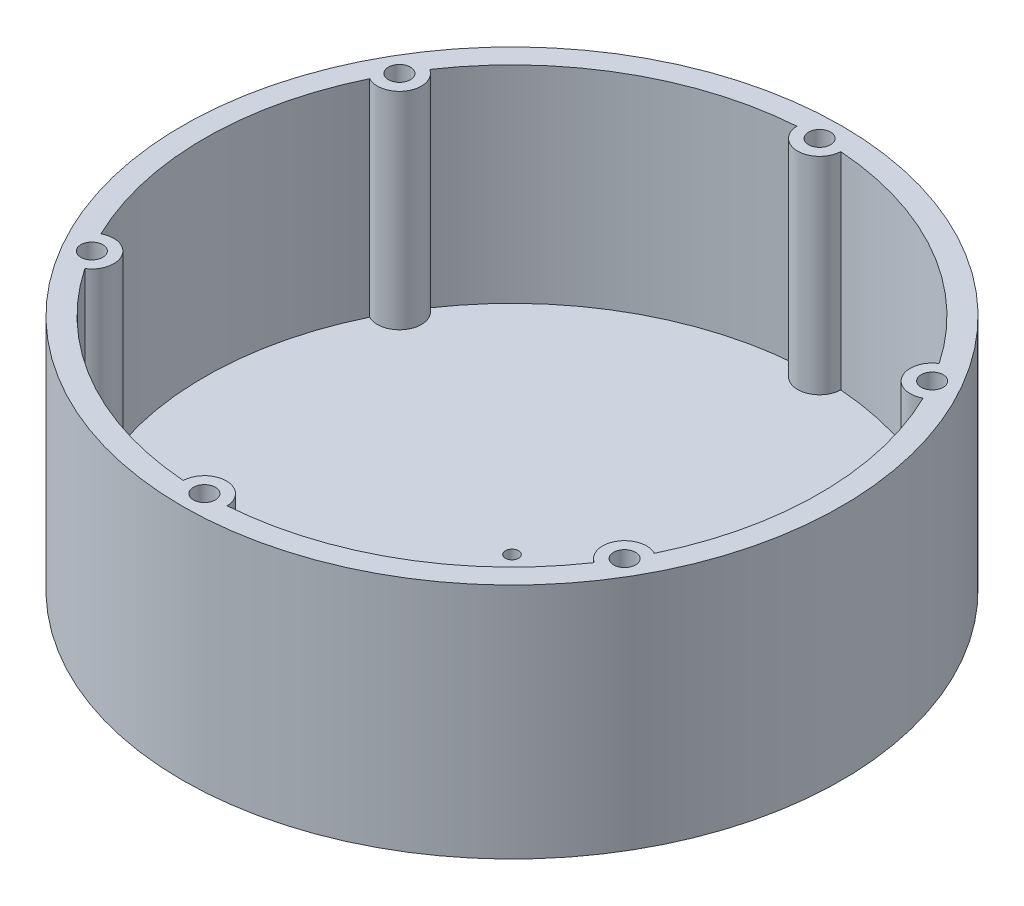
ISO-10303-21;
HEADER;
FILE_DESCRIPTION(('STEP AP214'),'2;1');
FILE_NAME('part.step','',(''),(''),'','','');
FILE_SCHEMA(('AUTOMOTIVE_DESIGN { 1 0 10303 214 1 1 1 1 }'));
ENDSEC;
DATA;
#1=APPLICATION_CONTEXT('core data for automotive mechanical design processes');
#2=APPLICATION_PROTOCOL_DEFINITION('international standard','automotive_design',2000,#1);
#3=PRODUCT_CONTEXT('',#1,'mechanical');
#4=PRODUCT('Part','Part','',(#3));
#5=PRODUCT_RELATED_PRODUCT_CATEGORY('part','',(#4));
#6=PRODUCT_DEFINITION_FORMATION('','',#4);
#7=PRODUCT_DEFINITION_CONTEXT('part definition',#1,'design');
#8=PRODUCT_DEFINITION('design','',#6,#7);
#9=PRODUCT_DEFINITION_SHAPE('','',#8);
#10=(LENGTH_UNIT() NAMED_UNIT(*) SI_UNIT(.MILLI.,.METRE.));
#11=(NAMED_UNIT(*) PLANE_ANGLE_UNIT() SI_UNIT($,.RADIAN.));
#12=(NAMED_UNIT(*) SI_UNIT($,.STERADIAN.) SOLID_ANGLE_UNIT());
#13=UNCERTAINTY_MEASURE_WITH_UNIT(LENGTH_MEASURE(1.E-05),#10,'distance_accuracy_value','');
#14=(GEOMETRIC_REPRESENTATION_CONTEXT(3) GLOBAL_UNCERTAINTY_ASSIGNED_CONTEXT((#13)) GLOBAL_UNIT_ASSIGNED_CONTEXT((#10,
#11,#12)) REPRESENTATION_CONTEXT('',''));
#15=CARTESIAN_POINT('',(0.,0.,0.));
#16=DIRECTION('',(0.,0.,1.));
#17=DIRECTION('',(1.,0.,0.));
#18=AXIS2_PLACEMENT_3D('',#15,#16,#17);
#19=CARTESIAN_POINT('',(0.,-2.,0.));
#20=DIRECTION('',(0.,-1.,0.));
#21=DIRECTION('',(0.,0.,-1.));
#22=AXIS2_PLACEMENT_3D('',#19,#20,#21);
#23=PLANE('',#22);
#24=CARTESIAN_POINT('',(0.,-2.,0.));
#25=DIRECTION('',(0.,-1.,0.));
#26=DIRECTION('',(0.,0.,-1.));
#27=AXIS2_PLACEMENT_3D('',#24,#25,#26);
#28=CIRCLE('',#27,75.);
#29=CARTESIAN_POINT('',(0.,-2.,-75.));
#30=VERTEX_POINT('',#29);
#31=EDGE_CURVE('E164',#30,#30,#28,.T.);
#32=ORIENTED_EDGE('',*,*,#31,.T.);
#33=EDGE_LOOP('',(#32));
#34=FACE_BOUND('',#33,.T.);
#35=CARTESIAN_POINT('',(0.,-2.,0.));
#36=DIRECTION('',(0.,-1.,0.));
#37=DIRECTION('',(0.,0.,-1.));
#38=AXIS2_PLACEMENT_3D('',#35,#36,#37);
#39=CIRCLE('',#38,72.9);
#40=CARTESIAN_POINT('',(0.,-2.,-72.9));
#41=VERTEX_POINT('',#40);
#42=EDGE_CURVE('E12',#41,#41,#39,.T.);
#43=ORIENTED_EDGE('',*,*,#42,.F.);
#44=EDGE_LOOP('',(#43));
#45=FACE_BOUND('',#44,.T.);
#46=ADVANCED_FACE('F61',(#34,#45),#23,.T.);
#47=CARTESIAN_POINT('',(0.,-2.,0.));
#48=DIRECTION('',(0.,-1.,0.));
#49=DIRECTION('',(0.,0.,-1.));
#50=AXIS2_PLACEMENT_3D('',#47,#48,#49);
#51=CIRCLE('',#50,65.);
#52=CARTESIAN_POINT('',(0.,-2.,-65.));
#53=VERTEX_POINT('',#52);
#54=EDGE_CURVE('E449',#53,#53,#51,.T.);
#55=ORIENTED_EDGE('',*,*,#54,.F.);
#56=EDGE_LOOP('',(#55));
#57=FACE_BOUND('',#56,.T.);
#58=CARTESIAN_POINT('',(0.,-2.,0.));
#59=DIRECTION('',(0.,1.,0.));
#60=DIRECTION('',(0.,0.,1.));
#61=AXIS2_PLACEMENT_3D('',#58,#59,#60);
#62=CIRCLE('',#61,67.1);
#63=CARTESIAN_POINT('',(0.,-2.,-67.1));
#64=VERTEX_POINT('',#63);
#65=EDGE_CURVE('E70',#64,#64,#62,.T.);
#66=ORIENTED_EDGE('',*,*,#65,.F.);
#67=EDGE_LOOP('',(#66));
#68=FACE_BOUND('',#67,.T.);
#69=ADVANCED_FACE('F318',(#57,#68),#23,.T.);
#70=CARTESIAN_POINT('',(0.,0.,0.));
#71=DIRECTION('',(0.,1.,0.));
#72=DIRECTION('',(0.,0.,1.));
#73=AXIS2_PLACEMENT_3D('',#70,#71,#72);
#74=PLANE('',#73);
#75=CARTESIAN_POINT('',(0.,0.,0.));
#76=DIRECTION('',(0.,-1.,0.));
#77=DIRECTION('',(0.,0.,-1.));
#78=AXIS2_PLACEMENT_3D('',#75,#76,#77);
#79=CIRCLE('',#78,1.5);
#80=CARTESIAN_POINT('',(0.,0.,-1.5));
#81=VERTEX_POINT('',#80);
#82=EDGE_CURVE('E254',#81,#81,#79,.T.);
#83=ORIENTED_EDGE('',*,*,#82,.F.);
#84=EDGE_LOOP('',(#83));
#85=FACE_BOUND('',#84,.T.);
#86=CARTESIAN_POINT('',(0.,0.,0.));
#87=DIRECTION('',(0.,-1.,0.));
#88=DIRECTION('',(0.,0.,-1.));
#89=AXIS2_PLACEMENT_3D('',#86,#87,#88);
#90=CIRCLE('',#89,65.);
#91=CARTESIAN_POINT('',(0.,0.,-65.));
#92=VERTEX_POINT('',#91);
#93=EDGE_CURVE('E446',#92,#92,#90,.T.);
#94=ORIENTED_EDGE('',*,*,#93,.T.);
#95=EDGE_LOOP('',(#94));
#96=FACE_BOUND('',#95,.T.);
#97=ADVANCED_FACE('F320',(#85,#96),#74,.F.);
#98=CARTESIAN_POINT('',(0.,52.,0.));
#99=DIRECTION('',(0.,1.,0.));
#100=DIRECTION('',(0.,0.,1.));
#101=AXIS2_PLACEMENT_3D('',#98,#99,#100);
#102=PLANE('',#101);
#103=CARTESIAN_POINT('',(0.,52.,-70.));
#104=DIRECTION('',(0.,1.,0.));
#105=DIRECTION('',(0.,0.,1.));
#106=AXIS2_PLACEMENT_3D('',#103,#104,#105);
#107=CIRCLE('',#106,2.5);
#108=CARTESIAN_POINT('',(0.,52.,-67.5));
#109=VERTEX_POINT('',#108);
#110=EDGE_CURVE('E268',#109,#109,#107,.T.);
#111=ORIENTED_EDGE('',*,*,#110,.F.);
#112=EDGE_LOOP('',(#111));
#113=FACE_BOUND('',#112,.T.);
#114=CARTESIAN_POINT('',(-60.6217782649103,52.,-35.0000000000007));
#115=DIRECTION('',(0.,1.,0.));
#116=DIRECTION('',(0.,0.,1.));
#117=AXIS2_PLACEMENT_3D('',#114,#115,#116);
#118=CIRCLE('',#117,2.5);
#119=CARTESIAN_POINT('',(-60.6217782649103,52.,-32.5000000000007));
#120=VERTEX_POINT('',#119);
#121=EDGE_CURVE('E273',#120,#120,#118,.T.);
#122=ORIENTED_EDGE('',*,*,#121,.F.);
#123=EDGE_LOOP('',(#122));
#124=FACE_BOUND('',#123,.T.);
#125=CARTESIAN_POINT('',(-60.621778264911,52.,34.9999999999995));
#126=DIRECTION('',(0.,1.,0.));
#127=DIRECTION('',(0.,0.,1.));
#128=AXIS2_PLACEMENT_3D('',#125,#126,#127);
#129=CIRCLE('',#128,2.5);
#130=CARTESIAN_POINT('',(-60.621778264911,52.,37.4999999999995));
#131=VERTEX_POINT('',#130);
#132=EDGE_CURVE('E304',#131,#131,#129,.T.);
#133=ORIENTED_EDGE('',*,*,#132,.F.);
#134=EDGE_LOOP('',(#133));
#135=FACE_BOUND('',#134,.T.);
#136=CARTESIAN_POINT('',(-4.88807387438039E-13,52.,70.));
#137=DIRECTION('',(0.,1.,0.));
#138=DIRECTION('',(0.,0.,1.));
#139=AXIS2_PLACEMENT_3D('',#136,#137,#138);
#140=CIRCLE('',#139,2.5);
#141=CARTESIAN_POINT('',(-4.88807387438039E-13,52.,72.5));
#142=VERTEX_POINT('',#141);
#143=EDGE_CURVE('E296',#142,#142,#140,.T.);
#144=ORIENTED_EDGE('',*,*,#143,.F.);
#145=EDGE_LOOP('',(#144));
#146=FACE_BOUND('',#145,.T.);
#147=CARTESIAN_POINT('',(60.6217782649106,52.,35.0000000000003));
#148=DIRECTION('',(0.,1.,0.));
#149=DIRECTION('',(0.,0.,1.));
#150=AXIS2_PLACEMENT_3D('',#147,#148,#149);
#151=CIRCLE('',#150,2.50000000000001);
#152=CARTESIAN_POINT('',(60.6217782649106,52.,37.5000000000003));
#153=VERTEX_POINT('',#152);
#154=EDGE_CURVE('E288',#153,#153,#151,.T.);
#155=ORIENTED_EDGE('',*,*,#154,.F.);
#156=EDGE_LOOP('',(#155));
#157=FACE_BOUND('',#156,.T.);
#158=CARTESIAN_POINT('',(60.6217782649108,52.,-34.9999999999999));
#159=DIRECTION('',(0.,1.,0.));
#160=DIRECTION('',(0.,0.,1.));
#161=AXIS2_PLACEMENT_3D('',#158,#159,#160);
#162=CIRCLE('',#161,2.50000000000001);
#163=CARTESIAN_POINT('',(60.6217782649108,52.,-32.4999999999999));
#164=VERTEX_POINT('',#163);
#165=EDGE_CURVE('E272',#164,#164,#162,.T.);
#166=ORIENTED_EDGE('',*,*,#165,.F.);
#167=EDGE_LOOP('',(#166));
#168=FACE_BOUND('',#167,.T.);
#169=CARTESIAN_POINT('',(0.,52.,0.));
#170=DIRECTION('',(0.,1.,0.));
#171=DIRECTION('',(0.,0.,1.));
#172=AXIS2_PLACEMENT_3D('',#169,#170,#171);
#173=CIRCLE('',#172,75.);
#174=CARTESIAN_POINT('',(0.,52.,75.));
#175=VERTEX_POINT('',#174);
#176=EDGE_CURVE('E267',#175,#175,#173,.T.);
#177=ORIENTED_EDGE('',*,*,#176,.T.);
#178=EDGE_LOOP('',(#177));
#179=FACE_BOUND('',#178,.T.);
#180=CARTESIAN_POINT('',(0.,52.,0.));
#181=DIRECTION('',(0.,1.,0.));
#182=DIRECTION('',(0.,0.,1.));
#183=AXIS2_PLACEMENT_3D('',#180,#181,#182);
#184=CIRCLE('',#183,70.);
#185=CARTESIAN_POINT('',(-57.9687257678722,52.,39.2380788628754));
#186=VERTEX_POINT('',#185);
#187=CARTESIAN_POINT('',(-4.99681020701241,52.,69.8214285714286));
#188=VERTEX_POINT('',#187);
#189=EDGE_CURVE('E163',#186,#188,#184,.T.);
#190=ORIENTED_EDGE('',*,*,#189,.F.);
#191=CARTESIAN_POINT('',(-60.6217782649111,52.,34.9999999999994));
#192=DIRECTION('',(0.,-1.,0.));
#193=DIRECTION('',(0.,0.,1.));
#194=AXIS2_PLACEMENT_3D('',#191,#192,#193);
#195=CIRCLE('',#194,5.00000000000005);
#196=CARTESIAN_POINT('',(-62.965535974884,52.,30.583349708552));
#197=VERTEX_POINT('',#196);
#198=EDGE_CURVE('E152',#197,#186,#195,.T.);
#199=ORIENTED_EDGE('',*,*,#198,.F.);
#200=CARTESIAN_POINT('',(0.,52.,0.));
#201=DIRECTION('',(0.,1.,0.));
#202=DIRECTION('',(0.,0.,1.));
#203=AXIS2_PLACEMENT_3D('',#200,#201,#202);
#204=CIRCLE('',#203,70.);
#205=CARTESIAN_POINT('',(-62.9655359748834,52.,-30.5833497085534));
#206=VERTEX_POINT('',#205);
#207=EDGE_CURVE('E175',#206,#197,#204,.T.);
#208=ORIENTED_EDGE('',*,*,#207,.F.);
#209=CARTESIAN_POINT('',(-60.6217782649103,52.,-35.0000000000007));
#210=DIRECTION('',(0.,-1.,0.));
#211=DIRECTION('',(0.,0.,1.));
#212=AXIS2_PLACEMENT_3D('',#209,#210,#211);
#213=CIRCLE('',#212,5.00000000000005);
#214=CARTESIAN_POINT('',(-57.9687257678714,52.,-39.2380788628767));
#215=VERTEX_POINT('',#214);
#216=EDGE_CURVE('E213',#215,#206,#213,.T.);
#217=ORIENTED_EDGE('',*,*,#216,.F.);
#218=CARTESIAN_POINT('',(0.,52.,0.));
#219=DIRECTION('',(0.,1.,0.));
#220=DIRECTION('',(0.,0.,1.));
#221=AXIS2_PLACEMENT_3D('',#218,#219,#220);
#222=CIRCLE('',#221,70.);
#223=CARTESIAN_POINT('',(-4.99681020701188,52.,-69.8214285714286));
#224=VERTEX_POINT('',#223);
#225=EDGE_CURVE('E209',#224,#215,#222,.T.);
#226=ORIENTED_EDGE('',*,*,#225,.F.);
#227=CARTESIAN_POINT('',(0.,52.,-70.));
#228=DIRECTION('',(0.,-1.,0.));
#229=DIRECTION('',(0.,0.,1.));
#230=AXIS2_PLACEMENT_3D('',#227,#228,#229);
#231=CIRCLE('',#230,5.00000000000005);
#232=CARTESIAN_POINT('',(4.99681020701193,52.,-69.8214285714286));
#233=VERTEX_POINT('',#232);
#234=EDGE_CURVE('E206',#233,#224,#231,.T.);
#235=ORIENTED_EDGE('',*,*,#234,.F.);
#236=CARTESIAN_POINT('',(0.,52.,0.));
#237=DIRECTION('',(0.,1.,0.));
#238=DIRECTION('',(0.,0.,1.));
#239=AXIS2_PLACEMENT_3D('',#236,#237,#238);
#240=CIRCLE('',#239,70.);
#241=CARTESIAN_POINT('',(57.9687257678719,52.,-39.2380788628759));
#242=VERTEX_POINT('',#241);
#243=EDGE_CURVE('E202',#242,#233,#240,.T.);
#244=ORIENTED_EDGE('',*,*,#243,.F.);
#245=CARTESIAN_POINT('',(60.6217782649108,52.,-34.9999999999998));
#246=DIRECTION('',(0.,-1.,0.));
#247=DIRECTION('',(0.,0.,1.));
#248=AXIS2_PLACEMENT_3D('',#245,#246,#247);
#249=CIRCLE('',#248,5.00000000000005);
#250=CARTESIAN_POINT('',(62.9655359748838,52.,-30.5833497085524));
#251=VERTEX_POINT('',#250);
#252=EDGE_CURVE('E199',#251,#242,#249,.T.);
#253=ORIENTED_EDGE('',*,*,#252,.F.);
#254=CARTESIAN_POINT('',(0.,52.,0.));
#255=DIRECTION('',(0.,1.,0.));
#256=DIRECTION('',(0.,0.,1.));
#257=AXIS2_PLACEMENT_3D('',#254,#255,#256);
#258=CIRCLE('',#257,70.);
#259=CARTESIAN_POINT('',(62.9655359748836,52.,30.5833497085529));
#260=VERTEX_POINT('',#259);
#261=EDGE_CURVE('E195',#260,#251,#258,.T.);
#262=ORIENTED_EDGE('',*,*,#261,.F.);
#263=CARTESIAN_POINT('',(60.6217782649105,52.,35.0000000000003));
#264=DIRECTION('',(0.,-1.,0.));
#265=DIRECTION('',(0.,0.,1.));
#266=AXIS2_PLACEMENT_3D('',#263,#264,#265);
#267=CIRCLE('',#266,5.00000000000005);
#268=CARTESIAN_POINT('',(57.9687257678716,52.,39.2380788628763));
#269=VERTEX_POINT('',#268);
#270=EDGE_CURVE('E192',#269,#260,#267,.T.);
#271=ORIENTED_EDGE('',*,*,#270,.F.);
#272=CARTESIAN_POINT('',(0.,52.,0.));
#273=DIRECTION('',(0.,1.,0.));
#274=DIRECTION('',(0.,0.,1.));
#275=AXIS2_PLACEMENT_3D('',#272,#273,#274);
#276=CIRCLE('',#275,70.);
#277=CARTESIAN_POINT('',(4.99681020701142,52.,69.8214285714286));
#278=VERTEX_POINT('',#277);
#279=EDGE_CURVE('E186',#278,#269,#276,.T.);
#280=ORIENTED_EDGE('',*,*,#279,.F.);
#281=CARTESIAN_POINT('',(-4.97805367561914E-13,52.,70.));
#282=DIRECTION('',(0.,-1.,0.));
#283=DIRECTION('',(0.,0.,1.));
#284=AXIS2_PLACEMENT_3D('',#281,#282,#283);
#285=CIRCLE('',#284,5.00000000000005);
#286=EDGE_CURVE('E179',#188,#278,#285,.T.);
#287=ORIENTED_EDGE('',*,*,#286,.F.);
#288=EDGE_LOOP('',(#190,#199,#208,#217,#226,#235,#244,#253,#262,#271,#280,#287));
#289=FACE_BOUND('',#288,.T.);
#290=ADVANCED_FACE('F177',(#113,#124,#135,#146,#157,#168,#179,#289),#102,.T.);
#291=CARTESIAN_POINT('',(0.,5.,0.));
#292=DIRECTION('',(0.,-1.,0.));
#293=DIRECTION('',(0.,0.,-1.));
#294=AXIS2_PLACEMENT_3D('',#291,#292,#293);
#295=CYLINDRICAL_SURFACE('',#294,75.);
#296=ORIENTED_EDGE('',*,*,#176,.F.);
#297=EDGE_LOOP('',(#296));
#298=FACE_BOUND('',#297,.T.);
#299=ORIENTED_EDGE('',*,*,#31,.F.);
#300=EDGE_LOOP('',(#299));
#301=FACE_BOUND('',#300,.T.);
#302=ADVANCED_FACE('F63',(#298,#301),#295,.T.);
#303=CARTESIAN_POINT('',(0.,5.,0.));
#304=DIRECTION('',(0.,1.,0.));
#305=DIRECTION('',(0.,0.,1.));
#306=AXIS2_PLACEMENT_3D('',#303,#304,#305);
#307=PLANE('',#306);
#308=CARTESIAN_POINT('',(0.,5.,0.));
#309=DIRECTION('',(0.,1.,0.));
#310=DIRECTION('',(0.,0.,1.));
#311=AXIS2_PLACEMENT_3D('',#308,#309,#310);
#312=CIRCLE('',#311,70.);
#313=CARTESIAN_POINT('',(-4.99681020701241,5.,69.8214285714286));
#314=VERTEX_POINT('',#313);
#315=CARTESIAN_POINT('',(-57.9687257678722,5.,39.2380788628754));
#316=VERTEX_POINT('',#315);
#317=EDGE_CURVE('E172',#314,#316,#312,.F.);
#318=ORIENTED_EDGE('',*,*,#317,.F.);
#319=CARTESIAN_POINT('',(-4.97805367561914E-13,5.,70.));
#320=DIRECTION('',(0.,1.,0.));
#321=DIRECTION('',(0.,0.,1.));
#322=AXIS2_PLACEMENT_3D('',#319,#320,#321);
#323=CIRCLE('',#322,5.00000000000005);
#324=CARTESIAN_POINT('',(4.99681020701142,5.,69.8214285714286));
#325=VERTEX_POINT('',#324);
#326=EDGE_CURVE('E220',#325,#314,#323,.T.);
#327=ORIENTED_EDGE('',*,*,#326,.F.);
#328=CARTESIAN_POINT('',(0.,5.,0.));
#329=DIRECTION('',(0.,1.,0.));
#330=DIRECTION('',(0.,0.,1.));
#331=AXIS2_PLACEMENT_3D('',#328,#329,#330);
#332=CIRCLE('',#331,70.);
#333=CARTESIAN_POINT('',(57.9687257678716,5.,39.2380788628763));
#334=VERTEX_POINT('',#333);
#335=EDGE_CURVE('E465',#334,#325,#332,.F.);
#336=ORIENTED_EDGE('',*,*,#335,.F.);
#337=CARTESIAN_POINT('',(60.6217782649105,5.,35.0000000000003));
#338=DIRECTION('',(0.,1.,0.));
#339=DIRECTION('',(0.,0.,1.));
#340=AXIS2_PLACEMENT_3D('',#337,#338,#339);
#341=CIRCLE('',#340,5.00000000000005);
#342=CARTESIAN_POINT('',(62.9655359748836,5.,30.5833497085529));
#343=VERTEX_POINT('',#342);
#344=EDGE_CURVE('E468',#343,#334,#341,.T.);
#345=ORIENTED_EDGE('',*,*,#344,.F.);
#346=CARTESIAN_POINT('',(0.,5.,0.));
#347=DIRECTION('',(0.,1.,0.));
#348=DIRECTION('',(0.,0.,1.));
#349=AXIS2_PLACEMENT_3D('',#346,#347,#348);
#350=CIRCLE('',#349,70.);
#351=CARTESIAN_POINT('',(62.9655359748838,5.,-30.5833497085524));
#352=VERTEX_POINT('',#351);
#353=EDGE_CURVE('E471',#352,#343,#350,.F.);
#354=ORIENTED_EDGE('',*,*,#353,.F.);
#355=CARTESIAN_POINT('',(60.6217782649108,5.,-34.9999999999998));
#356=DIRECTION('',(0.,1.,0.));
#357=DIRECTION('',(0.,0.,1.));
#358=AXIS2_PLACEMENT_3D('',#355,#356,#357);
#359=CIRCLE('',#358,5.00000000000005);
#360=CARTESIAN_POINT('',(57.9687257678719,5.,-39.2380788628759));
#361=VERTEX_POINT('',#360);
#362=EDGE_CURVE('E475',#361,#352,#359,.T.);
#363=ORIENTED_EDGE('',*,*,#362,.F.);
#364=CARTESIAN_POINT('',(0.,5.,0.));
#365=DIRECTION('',(0.,1.,0.));
#366=DIRECTION('',(0.,0.,1.));
#367=AXIS2_PLACEMENT_3D('',#364,#365,#366);
#368=CIRCLE('',#367,70.);
#369=CARTESIAN_POINT('',(4.99681020701193,5.,-69.8214285714286));
#370=VERTEX_POINT('',#369);
#371=EDGE_CURVE('E478',#370,#361,#368,.F.);
#372=ORIENTED_EDGE('',*,*,#371,.F.);
#373=CARTESIAN_POINT('',(0.,5.,-70.));
#374=DIRECTION('',(0.,1.,0.));
#375=DIRECTION('',(0.,0.,1.));
#376=AXIS2_PLACEMENT_3D('',#373,#374,#375);
#377=CIRCLE('',#376,5.00000000000005);
#378=CARTESIAN_POINT('',(-4.99681020701191,5.,-69.8214285714286));
#379=VERTEX_POINT('',#378);
#380=EDGE_CURVE('E482',#379,#370,#377,.T.);
#381=ORIENTED_EDGE('',*,*,#380,.F.);
#382=CARTESIAN_POINT('',(0.,5.,0.));
#383=DIRECTION('',(0.,1.,0.));
#384=DIRECTION('',(0.,0.,1.));
#385=AXIS2_PLACEMENT_3D('',#382,#383,#384);
#386=CIRCLE('',#385,70.);
#387=CARTESIAN_POINT('',(-57.9687257678714,5.,-39.2380788628767));
#388=VERTEX_POINT('',#387);
#389=EDGE_CURVE('E485',#388,#379,#386,.F.);
#390=ORIENTED_EDGE('',*,*,#389,.F.);
#391=CARTESIAN_POINT('',(-60.6217782649103,5.,-35.0000000000007));
#392=DIRECTION('',(0.,1.,0.));
#393=DIRECTION('',(0.,0.,1.));
#394=AXIS2_PLACEMENT_3D('',#391,#392,#393);
#395=CIRCLE('',#394,5.00000000000005);
#396=CARTESIAN_POINT('',(-62.9655359748834,5.,-30.5833497085533));
#397=VERTEX_POINT('',#396);
#398=EDGE_CURVE('E489',#397,#388,#395,.T.);
#399=ORIENTED_EDGE('',*,*,#398,.F.);
#400=CARTESIAN_POINT('',(0.,5.,0.));
#401=DIRECTION('',(0.,1.,0.));
#402=DIRECTION('',(0.,0.,1.));
#403=AXIS2_PLACEMENT_3D('',#400,#401,#402);
#404=CIRCLE('',#403,70.);
#405=CARTESIAN_POINT('',(-62.965535974884,5.,30.583349708552));
#406=VERTEX_POINT('',#405);
#407=EDGE_CURVE('E491',#406,#397,#404,.F.);
#408=ORIENTED_EDGE('',*,*,#407,.F.);
#409=CARTESIAN_POINT('',(-60.6217782649111,5.,34.9999999999994));
#410=DIRECTION('',(0.,1.,0.));
#411=DIRECTION('',(0.,0.,1.));
#412=AXIS2_PLACEMENT_3D('',#409,#410,#411);
#413=CIRCLE('',#412,5.00000000000005);
#414=EDGE_CURVE('E462',#316,#406,#413,.T.);
#415=ORIENTED_EDGE('',*,*,#414,.F.);
#416=EDGE_LOOP('',(#318,#327,#336,#345,#354,#363,#372,#381,#390,#399,#408,#415));
#417=FACE_BOUND('',#416,.T.);
#418=CARTESIAN_POINT('',(0.,5.,0.));
#419=DIRECTION('',(0.,1.,0.));
#420=DIRECTION('',(0.,0.,1.));
#421=AXIS2_PLACEMENT_3D('',#418,#419,#420);
#422=CIRCLE('',#421,1.5);
#423=CARTESIAN_POINT('',(0.,5.,1.5));
#424=VERTEX_POINT('',#423);
#425=EDGE_CURVE('E259',#424,#424,#422,.F.);
#426=ORIENTED_EDGE('',*,*,#425,.T.);
#427=EDGE_LOOP('',(#426));
#428=FACE_BOUND('',#427,.T.);
#429=ADVANCED_FACE('F402',(#417,#428),#307,.T.);
#430=CARTESIAN_POINT('',(60.6217782649108,36.,-34.9999999999999));
#431=DIRECTION('',(0.,1.,0.));
#432=DIRECTION('',(0.,0.,1.));
#433=AXIS2_PLACEMENT_3D('',#430,#431,#432);
#434=CYLINDRICAL_SURFACE('',#433,2.50000000000001);
#435=CARTESIAN_POINT('',(60.6217782649108,36.,-34.9999999999999));
#436=DIRECTION('',(0.,1.,0.));
#437=DIRECTION('',(0.,0.,1.));
#438=AXIS2_PLACEMENT_3D('',#435,#436,#437);
#439=CIRCLE('',#438,2.50000000000001);
#440=CARTESIAN_POINT('',(60.6217782649108,36.,-32.4999999999999));
#441=VERTEX_POINT('',#440);
#442=EDGE_CURVE('E284',#441,#441,#439,.T.);
#443=ORIENTED_EDGE('',*,*,#442,.F.);
#444=EDGE_LOOP('',(#443));
#445=FACE_BOUND('',#444,.T.);
#446=ORIENTED_EDGE('',*,*,#165,.T.);
#447=EDGE_LOOP('',(#446));
#448=FACE_BOUND('',#447,.T.);
#449=ADVANCED_FACE('F398',(#445,#448),#434,.F.);
#450=CARTESIAN_POINT('',(60.6217782649108,36.,-34.9999999999999));
#451=DIRECTION('',(0.,1.,0.));
#452=DIRECTION('',(0.,0.,1.));
#453=AXIS2_PLACEMENT_3D('',#450,#451,#452);
#454=PLANE('',#453);
#455=ORIENTED_EDGE('',*,*,#442,.T.);
#456=EDGE_LOOP('',(#455));
#457=FACE_BOUND('',#456,.T.);
#458=ADVANCED_FACE('F401',(#457),#454,.T.);
#459=CARTESIAN_POINT('',(60.6217782649106,36.,35.0000000000003));
#460=DIRECTION('',(0.,1.,0.));
#461=DIRECTION('',(0.,0.,1.));
#462=AXIS2_PLACEMENT_3D('',#459,#460,#461);
#463=CYLINDRICAL_SURFACE('',#462,2.50000000000001);
#464=CARTESIAN_POINT('',(60.6217782649106,36.,35.0000000000003));
#465=DIRECTION('',(0.,1.,0.));
#466=DIRECTION('',(0.,0.,1.));
#467=AXIS2_PLACEMENT_3D('',#464,#465,#466);
#468=CIRCLE('',#467,2.50000000000001);
#469=CARTESIAN_POINT('',(60.6217782649106,36.,37.5000000000003));
#470=VERTEX_POINT('',#469);
#471=EDGE_CURVE('E292',#470,#470,#468,.T.);
#472=ORIENTED_EDGE('',*,*,#471,.F.);
#473=EDGE_LOOP('',(#472));
#474=FACE_BOUND('',#473,.T.);
#475=ORIENTED_EDGE('',*,*,#154,.T.);
#476=EDGE_LOOP('',(#475));
#477=FACE_BOUND('',#476,.T.);
#478=ADVANCED_FACE('F406',(#474,#477),#463,.F.);
#479=CARTESIAN_POINT('',(60.6217782649106,36.,35.0000000000003));
#480=DIRECTION('',(0.,1.,0.));
#481=DIRECTION('',(0.,0.,1.));
#482=AXIS2_PLACEMENT_3D('',#479,#480,#481);
#483=PLANE('',#482);
#484=ORIENTED_EDGE('',*,*,#471,.T.);
#485=EDGE_LOOP('',(#484));
#486=FACE_BOUND('',#485,.T.);
#487=ADVANCED_FACE('F410',(#486),#483,.T.);
#488=CARTESIAN_POINT('',(-4.88807387438039E-13,36.,70.));
#489=DIRECTION('',(0.,1.,0.));
#490=DIRECTION('',(0.,0.,1.));
#491=AXIS2_PLACEMENT_3D('',#488,#489,#490);
#492=CYLINDRICAL_SURFACE('',#491,2.5);
#493=CARTESIAN_POINT('',(-4.88807387438039E-13,36.,70.));
#494=DIRECTION('',(0.,1.,0.));
#495=DIRECTION('',(0.,0.,1.));
#496=AXIS2_PLACEMENT_3D('',#493,#494,#495);
#497=CIRCLE('',#496,2.5);
#498=CARTESIAN_POINT('',(-4.88807387438039E-13,36.,72.5));
#499=VERTEX_POINT('',#498);
#500=EDGE_CURVE('E300',#499,#499,#497,.T.);
#501=ORIENTED_EDGE('',*,*,#500,.F.);
#502=EDGE_LOOP('',(#501));
#503=FACE_BOUND('',#502,.T.);
#504=ORIENTED_EDGE('',*,*,#143,.T.);
#505=EDGE_LOOP('',(#504));
#506=FACE_BOUND('',#505,.T.);
#507=ADVANCED_FACE('F414',(#503,#506),#492,.F.);
#508=CARTESIAN_POINT('',(-4.88807387438039E-13,36.,70.));
#509=DIRECTION('',(0.,1.,0.));
#510=DIRECTION('',(0.,0.,1.));
#511=AXIS2_PLACEMENT_3D('',#508,#509,#510);
#512=PLANE('',#511);
#513=ORIENTED_EDGE('',*,*,#500,.T.);
#514=EDGE_LOOP('',(#513));
#515=FACE_BOUND('',#514,.T.);
#516=ADVANCED_FACE('F418',(#515),#512,.T.);
#517=CARTESIAN_POINT('',(-60.621778264911,36.,34.9999999999995));
#518=DIRECTION('',(0.,1.,0.));
#519=DIRECTION('',(0.,0.,1.));
#520=AXIS2_PLACEMENT_3D('',#517,#518,#519);
#521=CYLINDRICAL_SURFACE('',#520,2.5);
#522=CARTESIAN_POINT('',(-60.621778264911,36.,34.9999999999995));
#523=DIRECTION('',(0.,1.,0.));
#524=DIRECTION('',(0.,0.,1.));
#525=AXIS2_PLACEMENT_3D('',#522,#523,#524);
#526=CIRCLE('',#525,2.5);
#527=CARTESIAN_POINT('',(-60.621778264911,36.,37.4999999999995));
#528=VERTEX_POINT('',#527);
#529=EDGE_CURVE('E277',#528,#528,#526,.T.);
#530=ORIENTED_EDGE('',*,*,#529,.F.);
#531=EDGE_LOOP('',(#530));
#532=FACE_BOUND('',#531,.T.);
#533=ORIENTED_EDGE('',*,*,#132,.T.);
#534=EDGE_LOOP('',(#533));
#535=FACE_BOUND('',#534,.T.);
#536=ADVANCED_FACE('F422',(#532,#535),#521,.F.);
#537=CARTESIAN_POINT('',(-60.621778264911,36.,34.9999999999995));
#538=DIRECTION('',(0.,1.,0.));
#539=DIRECTION('',(0.,0.,1.));
#540=AXIS2_PLACEMENT_3D('',#537,#538,#539);
#541=PLANE('',#540);
#542=ORIENTED_EDGE('',*,*,#529,.T.);
#543=EDGE_LOOP('',(#542));
#544=FACE_BOUND('',#543,.T.);
#545=ADVANCED_FACE('F393',(#544),#541,.T.);
#546=CARTESIAN_POINT('',(-60.6217782649103,36.,-35.0000000000007));
#547=DIRECTION('',(0.,1.,0.));
#548=DIRECTION('',(0.,0.,1.));
#549=AXIS2_PLACEMENT_3D('',#546,#547,#548);
#550=CYLINDRICAL_SURFACE('',#549,2.5);
#551=CARTESIAN_POINT('',(-60.6217782649103,36.,-35.0000000000007));
#552=DIRECTION('',(0.,1.,0.));
#553=DIRECTION('',(0.,0.,1.));
#554=AXIS2_PLACEMENT_3D('',#551,#552,#553);
#555=CIRCLE('',#554,2.5);
#556=CARTESIAN_POINT('',(-60.6217782649103,36.,-32.5000000000007));
#557=VERTEX_POINT('',#556);
#558=EDGE_CURVE('E258',#557,#557,#555,.T.);
#559=ORIENTED_EDGE('',*,*,#558,.F.);
#560=EDGE_LOOP('',(#559));
#561=FACE_BOUND('',#560,.T.);
#562=ORIENTED_EDGE('',*,*,#121,.T.);
#563=EDGE_LOOP('',(#562));
#564=FACE_BOUND('',#563,.T.);
#565=ADVANCED_FACE('F390',(#561,#564),#550,.F.);
#566=CARTESIAN_POINT('',(-60.6217782649103,36.,-35.0000000000007));
#567=DIRECTION('',(0.,1.,0.));
#568=DIRECTION('',(0.,0.,1.));
#569=AXIS2_PLACEMENT_3D('',#566,#567,#568);
#570=PLANE('',#569);
#571=ORIENTED_EDGE('',*,*,#558,.T.);
#572=EDGE_LOOP('',(#571));
#573=FACE_BOUND('',#572,.T.);
#574=ADVANCED_FACE('F388',(#573),#570,.T.);
#575=CARTESIAN_POINT('',(0.,36.,-70.));
#576=DIRECTION('',(0.,1.,0.));
#577=DIRECTION('',(0.,0.,1.));
#578=AXIS2_PLACEMENT_3D('',#575,#576,#577);
#579=CYLINDRICAL_SURFACE('',#578,2.5);
#580=CARTESIAN_POINT('',(0.,36.,-70.));
#581=DIRECTION('',(0.,1.,0.));
#582=DIRECTION('',(0.,0.,1.));
#583=AXIS2_PLACEMENT_3D('',#580,#581,#582);
#584=CIRCLE('',#583,2.5);
#585=CARTESIAN_POINT('',(0.,36.,-67.5));
#586=VERTEX_POINT('',#585);
#587=EDGE_CURVE('E263',#586,#586,#584,.T.);
#588=ORIENTED_EDGE('',*,*,#587,.F.);
#589=EDGE_LOOP('',(#588));
#590=FACE_BOUND('',#589,.T.);
#591=ORIENTED_EDGE('',*,*,#110,.T.);
#592=EDGE_LOOP('',(#591));
#593=FACE_BOUND('',#592,.T.);
#594=ADVANCED_FACE('F384',(#590,#593),#579,.F.);
#595=CARTESIAN_POINT('',(0.,36.,-70.));
#596=DIRECTION('',(0.,1.,0.));
#597=DIRECTION('',(0.,0.,1.));
#598=AXIS2_PLACEMENT_3D('',#595,#596,#597);
#599=PLANE('',#598);
#600=ORIENTED_EDGE('',*,*,#587,.T.);
#601=EDGE_LOOP('',(#600));
#602=FACE_BOUND('',#601,.T.);
#603=ADVANCED_FACE('F380',(#602),#599,.T.);
#604=CARTESIAN_POINT('',(0.,52.001,0.));
#605=DIRECTION('',(0.,-1.,0.));
#606=DIRECTION('',(0.,0.,-1.));
#607=AXIS2_PLACEMENT_3D('',#604,#605,#606);
#608=CYLINDRICAL_SURFACE('',#607,1.5);
#609=ORIENTED_EDGE('',*,*,#425,.F.);
#610=EDGE_LOOP('',(#609));
#611=FACE_BOUND('',#610,.T.);
#612=ORIENTED_EDGE('',*,*,#82,.T.);
#613=EDGE_LOOP('',(#612));
#614=FACE_BOUND('',#613,.T.);
#615=ADVANCED_FACE('F372',(#611,#614),#608,.F.);
#616=CARTESIAN_POINT('',(-4.97805367561914E-13,-192.737521859207,70.));
#617=DIRECTION('',(0.,1.,0.));
#618=DIRECTION('',(0.,0.,1.));
#619=AXIS2_PLACEMENT_3D('',#616,#617,#618);
#620=CYLINDRICAL_SURFACE('',#619,5.00000000000005);
#621=ORIENTED_EDGE('',*,*,#326,.T.);
#622=DIRECTION('',(0.,1.,0.));
#623=VECTOR('',#622,1.);
#624=CARTESIAN_POINT('',(-4.99681020701241,-192.737521859207,69.8214285714286));
#625=LINE('',#624,#623);
#626=EDGE_CURVE('E174',#314,#188,#625,.T.);
#627=ORIENTED_EDGE('',*,*,#626,.T.);
#628=ORIENTED_EDGE('',*,*,#286,.T.);
#629=DIRECTION('',(0.,1.,0.));
#630=VECTOR('',#629,1.);
#631=CARTESIAN_POINT('',(4.99681020701142,-192.737521859207,69.8214285714286));
#632=LINE('',#631,#630);
#633=EDGE_CURVE('E248',#325,#278,#632,.T.);
#634=ORIENTED_EDGE('',*,*,#633,.F.);
#635=EDGE_LOOP('',(#621,#627,#628,#634));
#636=FACE_BOUND('',#635,.T.);
#637=ADVANCED_FACE('F365',(#636),#620,.T.);
#638=CARTESIAN_POINT('',(60.6217782649105,-192.737521859207,35.0000000000003));
#639=DIRECTION('',(0.,1.,0.));
#640=DIRECTION('',(0.,0.,1.));
#641=AXIS2_PLACEMENT_3D('',#638,#639,#640);
#642=CYLINDRICAL_SURFACE('',#641,5.00000000000005);
#643=ORIENTED_EDGE('',*,*,#344,.T.);
#644=DIRECTION('',(0.,1.,0.));
#645=VECTOR('',#644,1.);
#646=CARTESIAN_POINT('',(57.9687257678716,-192.737521859207,39.2380788628763));
#647=LINE('',#646,#645);
#648=EDGE_CURVE('E245',#334,#269,#647,.T.);
#649=ORIENTED_EDGE('',*,*,#648,.T.);
#650=ORIENTED_EDGE('',*,*,#270,.T.);
#651=DIRECTION('',(0.,1.,0.));
#652=VECTOR('',#651,1.);
#653=CARTESIAN_POINT('',(62.9655359748836,-192.737521859207,30.5833497085529));
#654=LINE('',#653,#652);
#655=EDGE_CURVE('E241',#343,#260,#654,.T.);
#656=ORIENTED_EDGE('',*,*,#655,.F.);
#657=EDGE_LOOP('',(#643,#649,#650,#656));
#658=FACE_BOUND('',#657,.T.);
#659=ADVANCED_FACE('F357',(#658),#642,.T.);
#660=CARTESIAN_POINT('',(60.6217782649108,-192.737521859207,-34.9999999999998));
#661=DIRECTION('',(0.,1.,0.));
#662=DIRECTION('',(0.,0.,1.));
#663=AXIS2_PLACEMENT_3D('',#660,#661,#662);
#664=CYLINDRICAL_SURFACE('',#663,5.00000000000005);
#665=ORIENTED_EDGE('',*,*,#362,.T.);
#666=DIRECTION('',(0.,1.,0.));
#667=VECTOR('',#666,1.);
#668=CARTESIAN_POINT('',(62.9655359748838,-192.737521859207,-30.5833497085524));
#669=LINE('',#668,#667);
#670=EDGE_CURVE('E238',#352,#251,#669,.T.);
#671=ORIENTED_EDGE('',*,*,#670,.T.);
#672=ORIENTED_EDGE('',*,*,#252,.T.);
#673=DIRECTION('',(0.,1.,0.));
#674=VECTOR('',#673,1.);
#675=CARTESIAN_POINT('',(57.9687257678719,-192.737521859207,-39.2380788628759));
#676=LINE('',#675,#674);
#677=EDGE_CURVE('E234',#361,#242,#676,.T.);
#678=ORIENTED_EDGE('',*,*,#677,.F.);
#679=EDGE_LOOP('',(#665,#671,#672,#678));
#680=FACE_BOUND('',#679,.T.);
#681=ADVANCED_FACE('F349',(#680),#664,.T.);
#682=CARTESIAN_POINT('',(0.,-192.737521859207,-70.));
#683=DIRECTION('',(0.,1.,0.));
#684=DIRECTION('',(0.,0.,1.));
#685=AXIS2_PLACEMENT_3D('',#682,#683,#684);
#686=CYLINDRICAL_SURFACE('',#685,5.00000000000005);
#687=ORIENTED_EDGE('',*,*,#380,.T.);
#688=DIRECTION('',(0.,1.,0.));
#689=VECTOR('',#688,1.);
#690=CARTESIAN_POINT('',(4.99681020701193,-192.737521859207,-69.8214285714286));
#691=LINE('',#690,#689);
#692=EDGE_CURVE('E232',#370,#233,#691,.T.);
#693=ORIENTED_EDGE('',*,*,#692,.T.);
#694=ORIENTED_EDGE('',*,*,#234,.T.);
#695=DIRECTION('',(0.,1.,0.));
#696=VECTOR('',#695,1.);
#697=CARTESIAN_POINT('',(-4.99681020701188,-192.737521859207,-69.8214285714286));
#698=LINE('',#697,#696);
#699=EDGE_CURVE('E228',#379,#224,#698,.T.);
#700=ORIENTED_EDGE('',*,*,#699,.F.);
#701=EDGE_LOOP('',(#687,#693,#694,#700));
#702=FACE_BOUND('',#701,.T.);
#703=ADVANCED_FACE('F341',(#702),#686,.T.);
#704=CARTESIAN_POINT('',(-60.6217782649103,-192.737521859207,-35.0000000000007));
#705=DIRECTION('',(0.,1.,0.));
#706=DIRECTION('',(0.,0.,1.));
#707=AXIS2_PLACEMENT_3D('',#704,#705,#706);
#708=CYLINDRICAL_SURFACE('',#707,5.00000000000005);
#709=ORIENTED_EDGE('',*,*,#398,.T.);
#710=DIRECTION('',(0.,1.,0.));
#711=VECTOR('',#710,1.);
#712=CARTESIAN_POINT('',(-57.9687257678714,-192.737521859207,-39.2380788628767));
#713=LINE('',#712,#711);
#714=EDGE_CURVE('E225',#388,#215,#713,.T.);
#715=ORIENTED_EDGE('',*,*,#714,.T.);
#716=ORIENTED_EDGE('',*,*,#216,.T.);
#717=DIRECTION('',(0.,1.,0.));
#718=VECTOR('',#717,1.);
#719=CARTESIAN_POINT('',(-62.9655359748834,-192.737521859207,-30.5833497085534));
#720=LINE('',#719,#718);
#721=EDGE_CURVE('E221',#397,#206,#720,.T.);
#722=ORIENTED_EDGE('',*,*,#721,.F.);
#723=EDGE_LOOP('',(#709,#715,#716,#722));
#724=FACE_BOUND('',#723,.T.);
#725=ADVANCED_FACE('F338',(#724),#708,.T.);
#726=CARTESIAN_POINT('',(-60.6217782649111,-192.737521859207,34.9999999999994));
#727=DIRECTION('',(0.,1.,0.));
#728=DIRECTION('',(0.,0.,1.));
#729=AXIS2_PLACEMENT_3D('',#726,#727,#728);
#730=CYLINDRICAL_SURFACE('',#729,5.00000000000005);
#731=ORIENTED_EDGE('',*,*,#414,.T.);
#732=DIRECTION('',(0.,1.,0.));
#733=VECTOR('',#732,1.);
#734=CARTESIAN_POINT('',(-62.965535974884,-192.737521859207,30.583349708552));
#735=LINE('',#734,#733);
#736=EDGE_CURVE('E157',#406,#197,#735,.T.);
#737=ORIENTED_EDGE('',*,*,#736,.T.);
#738=ORIENTED_EDGE('',*,*,#198,.T.);
#739=DIRECTION('',(0.,1.,0.));
#740=VECTOR('',#739,1.);
#741=CARTESIAN_POINT('',(-57.9687257678722,-192.737521859207,39.2380788628754));
#742=LINE('',#741,#740);
#743=EDGE_CURVE('E155',#316,#186,#742,.T.);
#744=ORIENTED_EDGE('',*,*,#743,.F.);
#745=EDGE_LOOP('',(#731,#737,#738,#744));
#746=FACE_BOUND('',#745,.T.);
#747=ADVANCED_FACE('F154',(#746),#730,.T.);
#748=CARTESIAN_POINT('',(0.,-192.737521859207,0.));
#749=DIRECTION('',(0.,1.,0.));
#750=DIRECTION('',(0.,0.,1.));
#751=AXIS2_PLACEMENT_3D('',#748,#749,#750);
#752=CYLINDRICAL_SURFACE('',#751,70.);
#753=ORIENTED_EDGE('',*,*,#317,.T.);
#754=ORIENTED_EDGE('',*,*,#743,.T.);
#755=ORIENTED_EDGE('',*,*,#189,.T.);
#756=ORIENTED_EDGE('',*,*,#626,.F.);
#757=EDGE_LOOP('',(#753,#754,#755,#756));
#758=FACE_BOUND('',#757,.T.);
#759=ADVANCED_FACE('F169',(#758),#752,.F.);
#760=CARTESIAN_POINT('',(0.,-192.737521859207,0.));
#761=DIRECTION('',(0.,1.,0.));
#762=DIRECTION('',(0.,0.,1.));
#763=AXIS2_PLACEMENT_3D('',#760,#761,#762);
#764=CYLINDRICAL_SURFACE('',#763,70.);
#765=ORIENTED_EDGE('',*,*,#335,.T.);
#766=ORIENTED_EDGE('',*,*,#633,.T.);
#767=ORIENTED_EDGE('',*,*,#279,.T.);
#768=ORIENTED_EDGE('',*,*,#648,.F.);
#769=EDGE_LOOP('',(#765,#766,#767,#768));
#770=FACE_BOUND('',#769,.T.);
#771=ADVANCED_FACE('F361',(#770),#764,.F.);
#772=CARTESIAN_POINT('',(0.,-192.737521859207,0.));
#773=DIRECTION('',(0.,1.,0.));
#774=DIRECTION('',(0.,0.,1.));
#775=AXIS2_PLACEMENT_3D('',#772,#773,#774);
#776=CYLINDRICAL_SURFACE('',#775,70.);
#777=ORIENTED_EDGE('',*,*,#353,.T.);
#778=ORIENTED_EDGE('',*,*,#655,.T.);
#779=ORIENTED_EDGE('',*,*,#261,.T.);
#780=ORIENTED_EDGE('',*,*,#670,.F.);
#781=EDGE_LOOP('',(#777,#778,#779,#780));
#782=FACE_BOUND('',#781,.T.);
#783=ADVANCED_FACE('F353',(#782),#776,.F.);
#784=CARTESIAN_POINT('',(0.,-192.737521859207,0.));
#785=DIRECTION('',(0.,1.,0.));
#786=DIRECTION('',(0.,0.,1.));
#787=AXIS2_PLACEMENT_3D('',#784,#785,#786);
#788=CYLINDRICAL_SURFACE('',#787,70.);
#789=ORIENTED_EDGE('',*,*,#371,.T.);
#790=ORIENTED_EDGE('',*,*,#677,.T.);
#791=ORIENTED_EDGE('',*,*,#243,.T.);
#792=ORIENTED_EDGE('',*,*,#692,.F.);
#793=EDGE_LOOP('',(#789,#790,#791,#792));
#794=FACE_BOUND('',#793,.T.);
#795=ADVANCED_FACE('F345',(#794),#788,.F.);
#796=CARTESIAN_POINT('',(0.,-192.737521859207,0.));
#797=DIRECTION('',(0.,1.,0.));
#798=DIRECTION('',(0.,0.,1.));
#799=AXIS2_PLACEMENT_3D('',#796,#797,#798);
#800=CYLINDRICAL_SURFACE('',#799,70.);
#801=ORIENTED_EDGE('',*,*,#389,.T.);
#802=ORIENTED_EDGE('',*,*,#699,.T.);
#803=ORIENTED_EDGE('',*,*,#225,.T.);
#804=ORIENTED_EDGE('',*,*,#714,.F.);
#805=EDGE_LOOP('',(#801,#802,#803,#804));
#806=FACE_BOUND('',#805,.T.);
#807=ADVANCED_FACE('F336',(#806),#800,.F.);
#808=CARTESIAN_POINT('',(0.,-192.737521859207,0.));
#809=DIRECTION('',(0.,1.,0.));
#810=DIRECTION('',(0.,0.,1.));
#811=AXIS2_PLACEMENT_3D('',#808,#809,#810);
#812=CYLINDRICAL_SURFACE('',#811,70.);
#813=ORIENTED_EDGE('',*,*,#407,.T.);
#814=ORIENTED_EDGE('',*,*,#721,.T.);
#815=ORIENTED_EDGE('',*,*,#207,.T.);
#816=ORIENTED_EDGE('',*,*,#736,.F.);
#817=EDGE_LOOP('',(#813,#814,#815,#816));
#818=FACE_BOUND('',#817,.T.);
#819=ADVANCED_FACE('F333',(#818),#812,.F.);
#820=CARTESIAN_POINT('',(0.,-2.,0.));
#821=DIRECTION('',(0.,1.,0.));
#822=DIRECTION('',(0.,0.,1.));
#823=AXIS2_PLACEMENT_3D('',#820,#821,#822);
#824=CYLINDRICAL_SURFACE('',#823,65.);
#825=ORIENTED_EDGE('',*,*,#54,.T.);
#826=EDGE_LOOP('',(#825));
#827=FACE_BOUND('',#826,.T.);
#828=ORIENTED_EDGE('',*,*,#93,.F.);
#829=EDGE_LOOP('',(#828));
#830=FACE_BOUND('',#829,.T.);
#831=ADVANCED_FACE('F331',(#827,#830),#824,.F.);
#832=CARTESIAN_POINT('',(0.,-2.,0.));
#833=DIRECTION('',(0.,-1.,0.));
#834=DIRECTION('',(0.,0.,-1.));
#835=AXIS2_PLACEMENT_3D('',#832,#833,#834);
#836=TOROIDAL_SURFACE('',#835,70.,2.9);
#837=ORIENTED_EDGE('',*,*,#42,.T.);
#838=CARTESIAN_POINT('',(0.,-2.,-70.));
#839=DIRECTION('',(1.,0.,0.));
#840=DIRECTION('',(0.,0.,-1.));
#841=AXIS2_PLACEMENT_3D('',#838,#839,#840);
#842=CIRCLE('',#841,2.9);
#843=EDGE_CURVE('E76',#41,#64,#842,.T.);
#844=ORIENTED_EDGE('',*,*,#843,.T.);
#845=ORIENTED_EDGE('',*,*,#65,.T.);
#846=ORIENTED_EDGE('',*,*,#843,.F.);
#847=EDGE_LOOP('',(#837,#844,#845,#846));
#848=FACE_BOUND('',#847,.T.);
#849=ADVANCED_FACE('F316',(#848),#836,.F.);
#850=CLOSED_SHELL('',(#46,#69,#97,#290,#302,#429,#449,#458,#478,#487,#507,#516,#536,#545,#565,
#574,#594,#603,#615,#637,#659,#681,#703,#725,#747,#759,#771,#783,#795,#807,#819,#831,#849));
#851=MANIFOLD_SOLID_BREP('B2',#850);
#852=ADVANCED_BREP_SHAPE_REPRESENTATION('',(#18,#851),#14);
#853=SHAPE_DEFINITION_REPRESENTATION(#9,#852);
ENDSEC;
END-ISO-10303-21;
